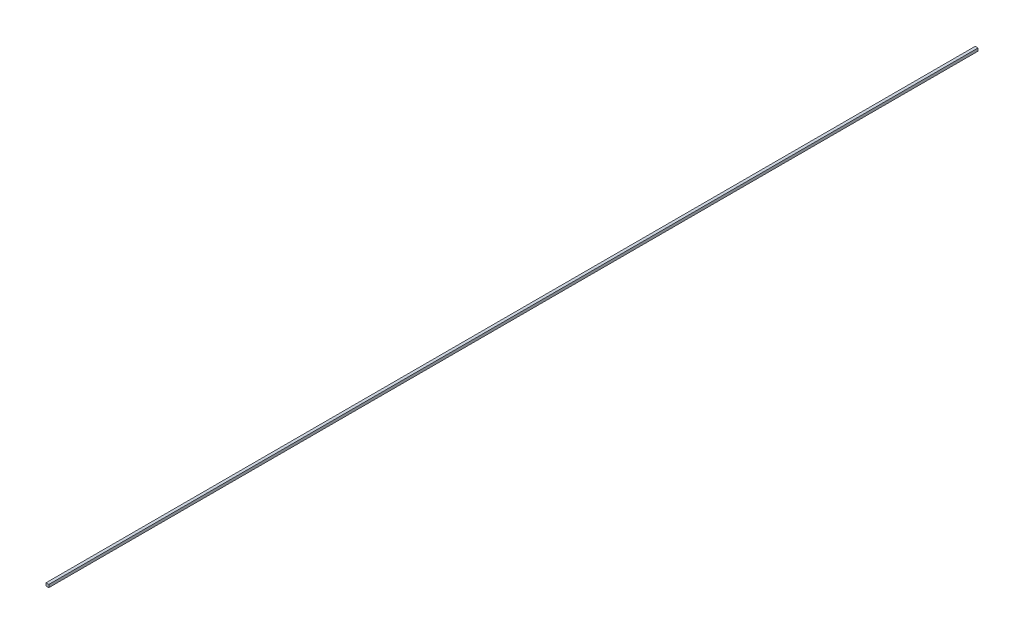
ISO-10303-21;
HEADER;
FILE_DESCRIPTION(('STEP AP214'),'2;1');
FILE_NAME('part.step','',(''),(''),'','','');
FILE_SCHEMA(('AUTOMOTIVE_DESIGN { 1 0 10303 214 1 1 1 1 }'));
ENDSEC;
DATA;
#1=APPLICATION_CONTEXT('core data for automotive mechanical design processes');
#2=APPLICATION_PROTOCOL_DEFINITION('international standard','automotive_design',2000,#1);
#3=PRODUCT_CONTEXT('',#1,'mechanical');
#4=PRODUCT('Part','Part','',(#3));
#5=PRODUCT_RELATED_PRODUCT_CATEGORY('part','',(#4));
#6=PRODUCT_DEFINITION_FORMATION('','',#4);
#7=PRODUCT_DEFINITION_CONTEXT('part definition',#1,'design');
#8=PRODUCT_DEFINITION('design','',#6,#7);
#9=PRODUCT_DEFINITION_SHAPE('','',#8);
#10=(LENGTH_UNIT() NAMED_UNIT(*) SI_UNIT(.MILLI.,.METRE.));
#11=(NAMED_UNIT(*) PLANE_ANGLE_UNIT() SI_UNIT($,.RADIAN.));
#12=(NAMED_UNIT(*) SI_UNIT($,.STERADIAN.) SOLID_ANGLE_UNIT());
#13=UNCERTAINTY_MEASURE_WITH_UNIT(LENGTH_MEASURE(1.E-05),#10,'distance_accuracy_value','');
#14=(GEOMETRIC_REPRESENTATION_CONTEXT(3) GLOBAL_UNCERTAINTY_ASSIGNED_CONTEXT((#13)) GLOBAL_UNIT_ASSIGNED_CONTEXT((#10,
#11,#12)) REPRESENTATION_CONTEXT('',''));
#15=CARTESIAN_POINT('',(0.,0.,0.));
#16=DIRECTION('',(0.,0.,1.));
#17=DIRECTION('',(1.,0.,0.));
#18=AXIS2_PLACEMENT_3D('',#15,#16,#17);
#19=CARTESIAN_POINT('',(0.,0.,0.));
#20=DIRECTION('',(-1.,0.,0.));
#21=DIRECTION('',(0.,0.,1.));
#22=AXIS2_PLACEMENT_3D('',#19,#20,#21);
#23=PLANE('',#22);
#24=DIRECTION('',(0.,0.,-1.));
#25=VECTOR('',#24,1.);
#26=CARTESIAN_POINT('',(0.,0.001270000000002,0.));
#27=LINE('',#26,#25);
#28=CARTESIAN_POINT('',(0.,0.001270000000002,0.41656));
#29=VERTEX_POINT('',#28);
#30=CARTESIAN_POINT('',(0.,0.001270000000002,0.));
#31=VERTEX_POINT('',#30);
#32=EDGE_CURVE('E26',#29,#31,#27,.T.);
#33=ORIENTED_EDGE('',*,*,#32,.T.);
#34=DIRECTION('',(0.,-1.,0.));
#35=VECTOR('',#34,1.);
#36=CARTESIAN_POINT('',(0.,0.,0.));
#37=LINE('',#36,#35);
#38=CARTESIAN_POINT('',(0.,0.,0.));
#39=VERTEX_POINT('',#38);
#40=EDGE_CURVE('E11',#31,#39,#37,.T.);
#41=ORIENTED_EDGE('',*,*,#40,.T.);
#42=DIRECTION('',(0.,0.,1.));
#43=VECTOR('',#42,1.);
#44=CARTESIAN_POINT('',(0.,0.,0.));
#45=LINE('',#44,#43);
#46=CARTESIAN_POINT('',(0.,0.,0.41656));
#47=VERTEX_POINT('',#46);
#48=EDGE_CURVE('E95',#39,#47,#45,.T.);
#49=ORIENTED_EDGE('',*,*,#48,.T.);
#50=DIRECTION('',(0.,1.,0.));
#51=VECTOR('',#50,1.);
#52=CARTESIAN_POINT('',(0.,0.,0.41656));
#53=LINE('',#52,#51);
#54=EDGE_CURVE('E56',#47,#29,#53,.T.);
#55=ORIENTED_EDGE('',*,*,#54,.T.);
#56=EDGE_LOOP('',(#33,#41,#49,#55));
#57=FACE_BOUND('',#56,.T.);
#58=ADVANCED_FACE('F17',(#57),#23,.T.);
#59=CARTESIAN_POINT('',(0.,0.,0.));
#60=DIRECTION('',(0.,0.,1.));
#61=DIRECTION('',(1.,0.,0.));
#62=AXIS2_PLACEMENT_3D('',#59,#60,#61);
#63=PLANE('',#62);
#64=DIRECTION('',(-1.,0.,0.));
#65=VECTOR('',#64,1.);
#66=CARTESIAN_POINT('',(0.,0.001270000000002,0.));
#67=LINE('',#66,#65);
#68=CARTESIAN_POINT('',(0.001270000000002,0.001270000000002,0.));
#69=VERTEX_POINT('',#68);
#70=EDGE_CURVE('E72',#69,#31,#67,.T.);
#71=ORIENTED_EDGE('',*,*,#70,.F.);
#72=DIRECTION('',(0.,1.,0.));
#73=VECTOR('',#72,1.);
#74=CARTESIAN_POINT('',(0.001270000000002,0.001270000000002,0.));
#75=LINE('',#74,#73);
#76=CARTESIAN_POINT('',(0.001270000000002,0.,0.));
#77=VERTEX_POINT('',#76);
#78=EDGE_CURVE('E99',#77,#69,#75,.T.);
#79=ORIENTED_EDGE('',*,*,#78,.F.);
#80=DIRECTION('',(1.,0.,0.));
#81=VECTOR('',#80,1.);
#82=CARTESIAN_POINT('',(0.001270000000002,0.,0.));
#83=LINE('',#82,#81);
#84=EDGE_CURVE('E86',#39,#77,#83,.T.);
#85=ORIENTED_EDGE('',*,*,#84,.F.);
#86=ORIENTED_EDGE('',*,*,#40,.F.);
#87=EDGE_LOOP('',(#71,#79,#85,#86));
#88=FACE_BOUND('',#87,.T.);
#89=ADVANCED_FACE('F123',(#88),#63,.F.);
#90=CARTESIAN_POINT('',(0.,0.001270000000002,0.));
#91=DIRECTION('',(0.,1.,0.));
#92=DIRECTION('',(1.,0.,0.));
#93=AXIS2_PLACEMENT_3D('',#90,#91,#92);
#94=PLANE('',#93);
#95=DIRECTION('',(0.,0.,-1.));
#96=VECTOR('',#95,1.);
#97=CARTESIAN_POINT('',(0.001270000000002,0.001270000000002,0.));
#98=LINE('',#97,#96);
#99=CARTESIAN_POINT('',(0.001270000000002,0.001270000000002,0.41656));
#100=VERTEX_POINT('',#99);
#101=EDGE_CURVE('E93',#100,#69,#98,.T.);
#102=ORIENTED_EDGE('',*,*,#101,.T.);
#103=ORIENTED_EDGE('',*,*,#70,.T.);
#104=ORIENTED_EDGE('',*,*,#32,.F.);
#105=DIRECTION('',(1.,0.,0.));
#106=VECTOR('',#105,1.);
#107=CARTESIAN_POINT('',(0.,0.001270000000002,0.41656));
#108=LINE('',#107,#106);
#109=EDGE_CURVE('E85',#29,#100,#108,.T.);
#110=ORIENTED_EDGE('',*,*,#109,.T.);
#111=EDGE_LOOP('',(#102,#103,#104,#110));
#112=FACE_BOUND('',#111,.T.);
#113=ADVANCED_FACE('F122',(#112),#94,.T.);
#114=CARTESIAN_POINT('',(0.,0.,0.41656));
#115=DIRECTION('',(0.,0.,1.));
#116=DIRECTION('',(1.,0.,0.));
#117=AXIS2_PLACEMENT_3D('',#114,#115,#116);
#118=PLANE('',#117);
#119=ORIENTED_EDGE('',*,*,#109,.F.);
#120=ORIENTED_EDGE('',*,*,#54,.F.);
#121=DIRECTION('',(1.,0.,0.));
#122=VECTOR('',#121,1.);
#123=CARTESIAN_POINT('',(0.,0.,0.41656));
#124=LINE('',#123,#122);
#125=CARTESIAN_POINT('',(0.001270000000002,0.,0.41656));
#126=VERTEX_POINT('',#125);
#127=EDGE_CURVE('E76',#47,#126,#124,.T.);
#128=ORIENTED_EDGE('',*,*,#127,.T.);
#129=DIRECTION('',(0.,1.,0.));
#130=VECTOR('',#129,1.);
#131=CARTESIAN_POINT('',(0.001270000000002,0.,0.41656));
#132=LINE('',#131,#130);
#133=EDGE_CURVE('E79',#126,#100,#132,.T.);
#134=ORIENTED_EDGE('',*,*,#133,.T.);
#135=EDGE_LOOP('',(#119,#120,#128,#134));
#136=FACE_BOUND('',#135,.T.);
#137=ADVANCED_FACE('F78',(#136),#118,.T.);
#138=CARTESIAN_POINT('',(0.001270000000002,0.,0.));
#139=DIRECTION('',(0.,-1.,0.));
#140=DIRECTION('',(0.,0.,-1.));
#141=AXIS2_PLACEMENT_3D('',#138,#139,#140);
#142=PLANE('',#141);
#143=ORIENTED_EDGE('',*,*,#48,.F.);
#144=ORIENTED_EDGE('',*,*,#84,.T.);
#145=DIRECTION('',(0.,0.,1.));
#146=VECTOR('',#145,1.);
#147=CARTESIAN_POINT('',(0.001270000000002,0.,0.));
#148=LINE('',#147,#146);
#149=EDGE_CURVE('E92',#77,#126,#148,.T.);
#150=ORIENTED_EDGE('',*,*,#149,.T.);
#151=ORIENTED_EDGE('',*,*,#127,.F.);
#152=EDGE_LOOP('',(#143,#144,#150,#151));
#153=FACE_BOUND('',#152,.T.);
#154=ADVANCED_FACE('F97',(#153),#142,.T.);
#155=CARTESIAN_POINT('',(0.001270000000002,0.001270000000002,0.));
#156=DIRECTION('',(1.,0.,0.));
#157=DIRECTION('',(0.,1.,0.));
#158=AXIS2_PLACEMENT_3D('',#155,#156,#157);
#159=PLANE('',#158);
#160=ORIENTED_EDGE('',*,*,#149,.F.);
#161=ORIENTED_EDGE('',*,*,#78,.T.);
#162=ORIENTED_EDGE('',*,*,#101,.F.);
#163=ORIENTED_EDGE('',*,*,#133,.F.);
#164=EDGE_LOOP('',(#160,#161,#162,#163));
#165=FACE_BOUND('',#164,.T.);
#166=ADVANCED_FACE('F90',(#165),#159,.T.);
#167=CLOSED_SHELL('',(#58,#89,#113,#137,#154,#166));
#168=MANIFOLD_SOLID_BREP('B1',#167);
#169=ADVANCED_BREP_SHAPE_REPRESENTATION('',(#18,#168),#14);
#170=SHAPE_DEFINITION_REPRESENTATION(#9,#169);
ENDSEC;
END-ISO-10303-21;
